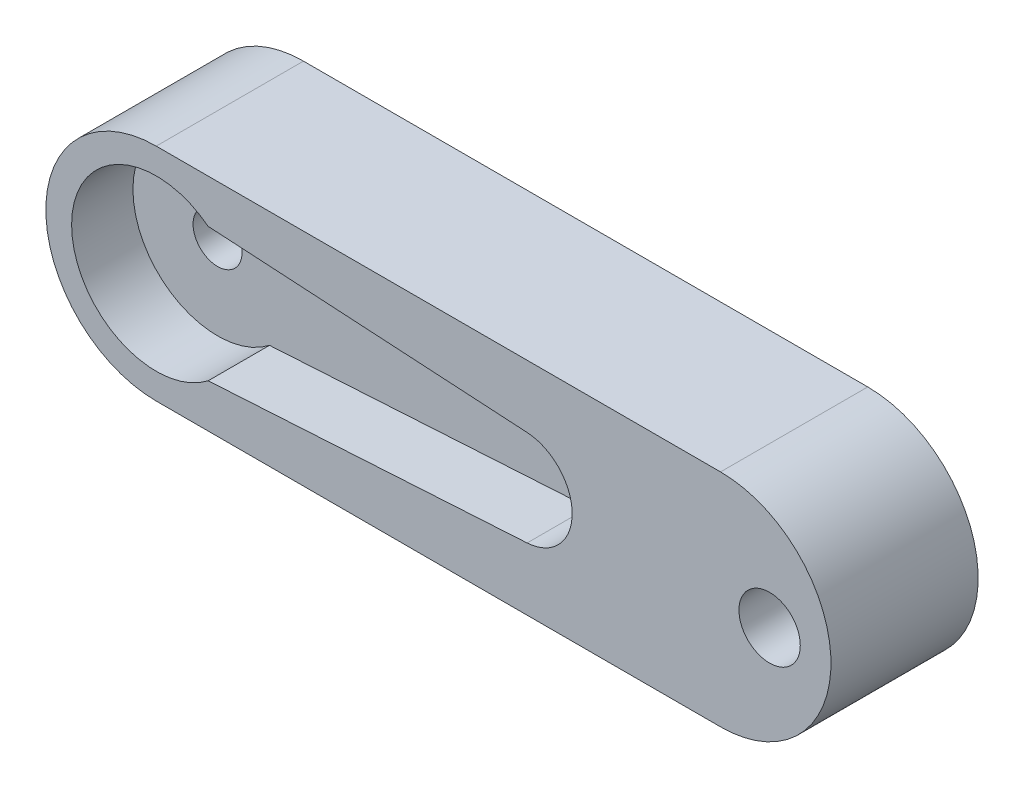
ISO-10303-21;
HEADER;
FILE_DESCRIPTION(('STEP AP214'),'2;1');
FILE_NAME('part.step','',(''),(''),'','','');
FILE_SCHEMA(('AUTOMOTIVE_DESIGN { 1 0 10303 214 1 1 1 1 }'));
ENDSEC;
DATA;
#1=APPLICATION_CONTEXT('core data for automotive mechanical design processes');
#2=APPLICATION_PROTOCOL_DEFINITION('international standard','automotive_design',2000,#1);
#3=PRODUCT_CONTEXT('',#1,'mechanical');
#4=PRODUCT('Part','Part','',(#3));
#5=PRODUCT_RELATED_PRODUCT_CATEGORY('part','',(#4));
#6=PRODUCT_DEFINITION_FORMATION('','',#4);
#7=PRODUCT_DEFINITION_CONTEXT('part definition',#1,'design');
#8=PRODUCT_DEFINITION('design','',#6,#7);
#9=PRODUCT_DEFINITION_SHAPE('','',#8);
#10=(LENGTH_UNIT() NAMED_UNIT(*) SI_UNIT(.MILLI.,.METRE.));
#11=(NAMED_UNIT(*) PLANE_ANGLE_UNIT() SI_UNIT($,.RADIAN.));
#12=(NAMED_UNIT(*) SI_UNIT($,.STERADIAN.) SOLID_ANGLE_UNIT());
#13=UNCERTAINTY_MEASURE_WITH_UNIT(LENGTH_MEASURE(1.E-05),#10,'distance_accuracy_value','');
#14=(GEOMETRIC_REPRESENTATION_CONTEXT(3) GLOBAL_UNCERTAINTY_ASSIGNED_CONTEXT((#13)) GLOBAL_UNIT_ASSIGNED_CONTEXT((#10,
#11,#12)) REPRESENTATION_CONTEXT('',''));
#15=CARTESIAN_POINT('',(0.,0.,0.));
#16=DIRECTION('',(0.,0.,1.));
#17=DIRECTION('',(1.,0.,0.));
#18=AXIS2_PLACEMENT_3D('',#15,#16,#17);
#19=CARTESIAN_POINT('',(0.,0.,0.));
#20=DIRECTION('',(0.,0.,1.));
#21=DIRECTION('',(1.,0.,0.));
#22=AXIS2_PLACEMENT_3D('',#19,#20,#21);
#23=CYLINDRICAL_SURFACE('',#22,1.);
#24=CARTESIAN_POINT('',(0.,0.,3.5));
#25=DIRECTION('',(0.,0.,1.));
#26=DIRECTION('',(1.,0.,0.));
#27=AXIS2_PLACEMENT_3D('',#24,#25,#26);
#28=CIRCLE('',#27,1.);
#29=CARTESIAN_POINT('',(1.,0.,3.5));
#30=VERTEX_POINT('',#29);
#31=EDGE_CURVE('E144',#30,#30,#28,.T.);
#32=ORIENTED_EDGE('',*,*,#31,.T.);
#33=EDGE_LOOP('',(#32));
#34=FACE_BOUND('',#33,.T.);
#35=CARTESIAN_POINT('',(0.,0.,1.5));
#36=DIRECTION('',(0.,0.,-1.));
#37=DIRECTION('',(-1.,0.,0.));
#38=AXIS2_PLACEMENT_3D('',#35,#36,#37);
#39=CIRCLE('',#38,1.);
#40=CARTESIAN_POINT('',(-1.,0.,1.5));
#41=VERTEX_POINT('',#40);
#42=EDGE_CURVE('E39',#41,#41,#39,.F.);
#43=ORIENTED_EDGE('',*,*,#42,.F.);
#44=EDGE_LOOP('',(#43));
#45=FACE_BOUND('',#44,.T.);
#46=ADVANCED_FACE('F35',(#34,#45),#23,.F.);
#47=CARTESIAN_POINT('',(0.,0.,6.));
#48=DIRECTION('',(0.,0.,-1.));
#49=DIRECTION('',(-1.,0.,0.));
#50=AXIS2_PLACEMENT_3D('',#47,#48,#49);
#51=CYLINDRICAL_SURFACE('',#50,4.5);
#52=CARTESIAN_POINT('',(0.,0.,0.));
#53=DIRECTION('',(0.,0.,1.));
#54=DIRECTION('',(1.,0.,0.));
#55=AXIS2_PLACEMENT_3D('',#52,#53,#54);
#56=CIRCLE('',#55,4.5);
#57=CARTESIAN_POINT('',(0.,4.5,0.));
#58=VERTEX_POINT('',#57);
#59=CARTESIAN_POINT('',(0.,-4.5,0.));
#60=VERTEX_POINT('',#59);
#61=EDGE_CURVE('E150',#58,#60,#56,.T.);
#62=ORIENTED_EDGE('',*,*,#61,.T.);
#63=DIRECTION('',(0.,0.,-1.));
#64=VECTOR('',#63,1.);
#65=CARTESIAN_POINT('',(0.,-4.5,6.));
#66=LINE('',#65,#64);
#67=CARTESIAN_POINT('',(0.,-4.5,6.));
#68=VERTEX_POINT('',#67);
#69=EDGE_CURVE('E11',#68,#60,#66,.T.);
#70=ORIENTED_EDGE('',*,*,#69,.F.);
#71=CARTESIAN_POINT('',(0.,0.,6.));
#72=DIRECTION('',(0.,0.,1.));
#73=DIRECTION('',(1.,0.,0.));
#74=AXIS2_PLACEMENT_3D('',#71,#72,#73);
#75=CIRCLE('',#74,4.5);
#76=CARTESIAN_POINT('',(0.,4.5,6.));
#77=VERTEX_POINT('',#76);
#78=EDGE_CURVE('E154',#77,#68,#75,.T.);
#79=ORIENTED_EDGE('',*,*,#78,.F.);
#80=DIRECTION('',(0.,0.,-1.));
#81=VECTOR('',#80,1.);
#82=CARTESIAN_POINT('',(0.,4.5,6.));
#83=LINE('',#82,#81);
#84=EDGE_CURVE('E160',#77,#58,#83,.T.);
#85=ORIENTED_EDGE('',*,*,#84,.T.);
#86=EDGE_LOOP('',(#62,#70,#79,#85));
#87=FACE_BOUND('',#86,.T.);
#88=ADVANCED_FACE('F37',(#87),#51,.T.);
#89=CARTESIAN_POINT('',(0.,-4.5,6.));
#90=DIRECTION('',(0.,1.,0.));
#91=DIRECTION('',(-1.,0.,0.));
#92=AXIS2_PLACEMENT_3D('',#89,#90,#91);
#93=PLANE('',#92);
#94=DIRECTION('',(1.,0.,0.));
#95=VECTOR('',#94,1.);
#96=CARTESIAN_POINT('',(0.,-4.5,0.));
#97=LINE('',#96,#95);
#98=CARTESIAN_POINT('',(23.,-4.5,0.));
#99=VERTEX_POINT('',#98);
#100=EDGE_CURVE('E163',#60,#99,#97,.T.);
#101=ORIENTED_EDGE('',*,*,#100,.T.);
#102=DIRECTION('',(0.,0.,-1.));
#103=VECTOR('',#102,1.);
#104=CARTESIAN_POINT('',(23.,-4.5,6.));
#105=LINE('',#104,#103);
#106=CARTESIAN_POINT('',(23.,-4.5,6.));
#107=VERTEX_POINT('',#106);
#108=EDGE_CURVE('E44',#107,#99,#105,.T.);
#109=ORIENTED_EDGE('',*,*,#108,.F.);
#110=DIRECTION('',(1.,0.,0.));
#111=VECTOR('',#110,1.);
#112=CARTESIAN_POINT('',(0.,-4.5,6.));
#113=LINE('',#112,#111);
#114=EDGE_CURVE('E89',#68,#107,#113,.T.);
#115=ORIENTED_EDGE('',*,*,#114,.F.);
#116=ORIENTED_EDGE('',*,*,#69,.T.);
#117=EDGE_LOOP('',(#101,#109,#115,#116));
#118=FACE_BOUND('',#117,.T.);
#119=ADVANCED_FACE('F211',(#118),#93,.F.);
#120=CARTESIAN_POINT('',(23.,0.,6.));
#121=DIRECTION('',(0.,0.,-1.));
#122=DIRECTION('',(-1.,0.,0.));
#123=AXIS2_PLACEMENT_3D('',#120,#121,#122);
#124=CYLINDRICAL_SURFACE('',#123,4.5);
#125=CARTESIAN_POINT('',(23.,0.,0.));
#126=DIRECTION('',(0.,0.,1.));
#127=DIRECTION('',(1.,0.,0.));
#128=AXIS2_PLACEMENT_3D('',#125,#126,#127);
#129=CIRCLE('',#128,4.5);
#130=CARTESIAN_POINT('',(23.,4.5,0.));
#131=VERTEX_POINT('',#130);
#132=EDGE_CURVE('E165',#99,#131,#129,.T.);
#133=ORIENTED_EDGE('',*,*,#132,.T.);
#134=DIRECTION('',(0.,0.,-1.));
#135=VECTOR('',#134,1.);
#136=CARTESIAN_POINT('',(23.,4.5,6.));
#137=LINE('',#136,#135);
#138=CARTESIAN_POINT('',(23.,4.5,6.));
#139=VERTEX_POINT('',#138);
#140=EDGE_CURVE('E169',#139,#131,#137,.T.);
#141=ORIENTED_EDGE('',*,*,#140,.F.);
#142=CARTESIAN_POINT('',(23.,0.,6.));
#143=DIRECTION('',(0.,0.,1.));
#144=DIRECTION('',(1.,0.,0.));
#145=AXIS2_PLACEMENT_3D('',#142,#143,#144);
#146=CIRCLE('',#145,4.5);
#147=EDGE_CURVE('E157',#107,#139,#146,.T.);
#148=ORIENTED_EDGE('',*,*,#147,.F.);
#149=ORIENTED_EDGE('',*,*,#108,.T.);
#150=EDGE_LOOP('',(#133,#141,#148,#149));
#151=FACE_BOUND('',#150,.T.);
#152=ADVANCED_FACE('F216',(#151),#124,.T.);
#153=CARTESIAN_POINT('',(0.,4.5,6.));
#154=DIRECTION('',(0.,-1.,0.));
#155=DIRECTION('',(1.,0.,0.));
#156=AXIS2_PLACEMENT_3D('',#153,#154,#155);
#157=PLANE('',#156);
#158=DIRECTION('',(-1.,0.,0.));
#159=VECTOR('',#158,1.);
#160=CARTESIAN_POINT('',(0.,4.5,0.));
#161=LINE('',#160,#159);
#162=EDGE_CURVE('E82',#131,#58,#161,.T.);
#163=ORIENTED_EDGE('',*,*,#162,.T.);
#164=ORIENTED_EDGE('',*,*,#84,.F.);
#165=DIRECTION('',(-1.,0.,0.));
#166=VECTOR('',#165,1.);
#167=CARTESIAN_POINT('',(0.,4.5,6.));
#168=LINE('',#167,#166);
#169=EDGE_CURVE('E61',#139,#77,#168,.T.);
#170=ORIENTED_EDGE('',*,*,#169,.F.);
#171=ORIENTED_EDGE('',*,*,#140,.T.);
#172=EDGE_LOOP('',(#163,#164,#170,#171));
#173=FACE_BOUND('',#172,.T.);
#174=ADVANCED_FACE('F204',(#173),#157,.F.);
#175=CARTESIAN_POINT('',(0.,0.,6.));
#176=DIRECTION('',(0.,0.,1.));
#177=DIRECTION('',(1.,0.,0.));
#178=AXIS2_PLACEMENT_3D('',#175,#176,#177);
#179=PLANE('',#178);
#180=CARTESIAN_POINT('',(25.,0.,6.));
#181=DIRECTION('',(0.,0.,1.));
#182=DIRECTION('',(1.,0.,0.));
#183=AXIS2_PLACEMENT_3D('',#180,#181,#182);
#184=CIRCLE('',#183,1.25);
#185=CARTESIAN_POINT('',(26.25,0.,6.));
#186=VERTEX_POINT('',#185);
#187=EDGE_CURVE('E185',#186,#186,#184,.T.);
#188=ORIENTED_EDGE('',*,*,#187,.F.);
#189=EDGE_LOOP('',(#188));
#190=FACE_BOUND('',#189,.T.);
#191=CARTESIAN_POINT('',(0.,0.,6.));
#192=DIRECTION('',(0.,0.,1.));
#193=DIRECTION('',(1.,0.,0.));
#194=AXIS2_PLACEMENT_3D('',#191,#192,#193);
#195=CIRCLE('',#194,3.45);
#196=CARTESIAN_POINT('',(2.11586270821148,2.725,6.));
#197=VERTEX_POINT('',#196);
#198=CARTESIAN_POINT('',(2.11586270821148,-2.725,6.));
#199=VERTEX_POINT('',#198);
#200=EDGE_CURVE('E52',#197,#199,#195,.T.);
#201=ORIENTED_EDGE('',*,*,#200,.F.);
#202=DIRECTION('',(-0.998227829931133,0.0595079788850305,0.));
#203=VECTOR('',#202,1.);
#204=CARTESIAN_POINT('',(2.11586270821148,2.725,6.));
#205=LINE('',#204,#203);
#206=CARTESIAN_POINT('',(15.1162465675134,1.95,6.));
#207=VERTEX_POINT('',#206);
#208=EDGE_CURVE('E131',#207,#197,#205,.T.);
#209=ORIENTED_EDGE('',*,*,#208,.F.);
#210=CARTESIAN_POINT('',(15.,0.,6.));
#211=DIRECTION('',(0.,0.,1.));
#212=DIRECTION('',(-1.,0.,0.));
#213=AXIS2_PLACEMENT_3D('',#210,#211,#212);
#214=CIRCLE('',#213,1.95346186665075);
#215=CARTESIAN_POINT('',(15.1162465675134,-1.95,6.));
#216=VERTEX_POINT('',#215);
#217=EDGE_CURVE('E134',#216,#207,#214,.T.);
#218=ORIENTED_EDGE('',*,*,#217,.F.);
#219=DIRECTION('',(0.998227829931133,0.0595079788850305,0.));
#220=VECTOR('',#219,1.);
#221=CARTESIAN_POINT('',(2.11586270821148,-2.725,6.));
#222=LINE('',#221,#220);
#223=EDGE_CURVE('E143',#199,#216,#222,.T.);
#224=ORIENTED_EDGE('',*,*,#223,.F.);
#225=EDGE_LOOP('',(#201,#209,#218,#224));
#226=FACE_BOUND('',#225,.T.);
#227=ORIENTED_EDGE('',*,*,#78,.T.);
#228=ORIENTED_EDGE('',*,*,#114,.T.);
#229=ORIENTED_EDGE('',*,*,#147,.T.);
#230=ORIENTED_EDGE('',*,*,#169,.T.);
#231=EDGE_LOOP('',(#227,#228,#229,#230));
#232=FACE_BOUND('',#231,.T.);
#233=ADVANCED_FACE('F201',(#190,#226,#232),#179,.T.);
#234=CARTESIAN_POINT('',(0.,0.,0.));
#235=DIRECTION('',(0.,0.,1.));
#236=DIRECTION('',(1.,0.,0.));
#237=AXIS2_PLACEMENT_3D('',#234,#235,#236);
#238=PLANE('',#237);
#239=CARTESIAN_POINT('',(25.,0.,0.));
#240=DIRECTION('',(0.,0.,1.));
#241=DIRECTION('',(1.,0.,0.));
#242=AXIS2_PLACEMENT_3D('',#239,#240,#241);
#243=CIRCLE('',#242,1.25);
#244=CARTESIAN_POINT('',(26.25,0.,0.));
#245=VERTEX_POINT('',#244);
#246=EDGE_CURVE('E183',#245,#245,#243,.T.);
#247=ORIENTED_EDGE('',*,*,#246,.T.);
#248=EDGE_LOOP('',(#247));
#249=FACE_BOUND('',#248,.T.);
#250=CARTESIAN_POINT('',(0.,0.,0.));
#251=DIRECTION('',(0.,0.,-1.));
#252=DIRECTION('',(-1.,0.,0.));
#253=AXIS2_PLACEMENT_3D('',#250,#251,#252);
#254=CIRCLE('',#253,2.);
#255=CARTESIAN_POINT('',(-2.,0.,0.));
#256=VERTEX_POINT('',#255);
#257=EDGE_CURVE('E137',#256,#256,#254,.T.);
#258=ORIENTED_EDGE('',*,*,#257,.F.);
#259=EDGE_LOOP('',(#258));
#260=FACE_BOUND('',#259,.T.);
#261=ORIENTED_EDGE('',*,*,#61,.F.);
#262=ORIENTED_EDGE('',*,*,#162,.F.);
#263=ORIENTED_EDGE('',*,*,#132,.F.);
#264=ORIENTED_EDGE('',*,*,#100,.F.);
#265=EDGE_LOOP('',(#261,#262,#263,#264));
#266=FACE_BOUND('',#265,.T.);
#267=ADVANCED_FACE('F191',(#249,#260,#266),#238,.F.);
#268=CARTESIAN_POINT('',(0.,0.,3.5));
#269=DIRECTION('',(0.,0.,1.));
#270=DIRECTION('',(1.,0.,0.));
#271=AXIS2_PLACEMENT_3D('',#268,#269,#270);
#272=CYLINDRICAL_SURFACE('',#271,3.45);
#273=ORIENTED_EDGE('',*,*,#200,.T.);
#274=DIRECTION('',(0.,0.,1.));
#275=VECTOR('',#274,1.);
#276=CARTESIAN_POINT('',(2.11586270821148,-2.725,3.5));
#277=LINE('',#276,#275);
#278=CARTESIAN_POINT('',(2.11586270821148,-2.725,3.5));
#279=VERTEX_POINT('',#278);
#280=EDGE_CURVE('E109',#279,#199,#277,.T.);
#281=ORIENTED_EDGE('',*,*,#280,.F.);
#282=CARTESIAN_POINT('',(0.,0.,3.5));
#283=DIRECTION('',(0.,0.,1.));
#284=DIRECTION('',(1.,0.,0.));
#285=AXIS2_PLACEMENT_3D('',#282,#283,#284);
#286=CIRCLE('',#285,3.45);
#287=CARTESIAN_POINT('',(2.11586270821148,2.725,3.5));
#288=VERTEX_POINT('',#287);
#289=EDGE_CURVE('E113',#288,#279,#286,.T.);
#290=ORIENTED_EDGE('',*,*,#289,.F.);
#291=DIRECTION('',(0.,0.,1.));
#292=VECTOR('',#291,1.);
#293=CARTESIAN_POINT('',(2.11586270821148,2.725,3.5));
#294=LINE('',#293,#292);
#295=EDGE_CURVE('E148',#288,#197,#294,.T.);
#296=ORIENTED_EDGE('',*,*,#295,.T.);
#297=EDGE_LOOP('',(#273,#281,#290,#296));
#298=FACE_BOUND('',#297,.T.);
#299=ADVANCED_FACE('F111',(#298),#272,.F.);
#300=CARTESIAN_POINT('',(2.11586270821148,2.725,3.5));
#301=DIRECTION('',(0.0595079788850305,0.998227829931133,0.));
#302=DIRECTION('',(-0.998227829931133,0.0595079788850305,0.));
#303=AXIS2_PLACEMENT_3D('',#300,#301,#302);
#304=PLANE('',#303);
#305=ORIENTED_EDGE('',*,*,#208,.T.);
#306=ORIENTED_EDGE('',*,*,#295,.F.);
#307=DIRECTION('',(-0.998227829931133,0.0595079788850305,0.));
#308=VECTOR('',#307,1.);
#309=CARTESIAN_POINT('',(2.11586270821148,2.725,3.5));
#310=LINE('',#309,#308);
#311=CARTESIAN_POINT('',(15.1162465675134,1.95,3.5));
#312=VERTEX_POINT('',#311);
#313=EDGE_CURVE('E119',#312,#288,#310,.T.);
#314=ORIENTED_EDGE('',*,*,#313,.F.);
#315=DIRECTION('',(0.,0.,1.));
#316=VECTOR('',#315,1.);
#317=CARTESIAN_POINT('',(15.1162465675134,1.95,3.5));
#318=LINE('',#317,#316);
#319=EDGE_CURVE('E151',#312,#207,#318,.T.);
#320=ORIENTED_EDGE('',*,*,#319,.T.);
#321=EDGE_LOOP('',(#305,#306,#314,#320));
#322=FACE_BOUND('',#321,.T.);
#323=ADVANCED_FACE('F223',(#322),#304,.F.);
#324=CARTESIAN_POINT('',(15.,0.,3.5));
#325=DIRECTION('',(0.,0.,1.));
#326=DIRECTION('',(1.,0.,0.));
#327=AXIS2_PLACEMENT_3D('',#324,#325,#326);
#328=CYLINDRICAL_SURFACE('',#327,1.95346186665075);
#329=ORIENTED_EDGE('',*,*,#217,.T.);
#330=ORIENTED_EDGE('',*,*,#319,.F.);
#331=CARTESIAN_POINT('',(15.,0.,3.5));
#332=DIRECTION('',(0.,0.,1.));
#333=DIRECTION('',(-1.,0.,0.));
#334=AXIS2_PLACEMENT_3D('',#331,#332,#333);
#335=CIRCLE('',#334,1.95346186665075);
#336=CARTESIAN_POINT('',(15.1162465675134,-1.95,3.5));
#337=VERTEX_POINT('',#336);
#338=EDGE_CURVE('E127',#337,#312,#335,.T.);
#339=ORIENTED_EDGE('',*,*,#338,.F.);
#340=DIRECTION('',(0.,0.,1.));
#341=VECTOR('',#340,1.);
#342=CARTESIAN_POINT('',(15.1162465675134,-1.95,3.5));
#343=LINE('',#342,#341);
#344=EDGE_CURVE('E118',#337,#216,#343,.T.);
#345=ORIENTED_EDGE('',*,*,#344,.T.);
#346=EDGE_LOOP('',(#329,#330,#339,#345));
#347=FACE_BOUND('',#346,.T.);
#348=ADVANCED_FACE('F241',(#347),#328,.F.);
#349=CARTESIAN_POINT('',(2.11586270821148,-2.725,3.5));
#350=DIRECTION('',(0.0595079788850305,-0.998227829931133,0.));
#351=DIRECTION('',(0.998227829931133,0.0595079788850305,0.));
#352=AXIS2_PLACEMENT_3D('',#349,#350,#351);
#353=PLANE('',#352);
#354=ORIENTED_EDGE('',*,*,#223,.T.);
#355=ORIENTED_EDGE('',*,*,#344,.F.);
#356=DIRECTION('',(0.998227829931133,0.0595079788850305,0.));
#357=VECTOR('',#356,1.);
#358=CARTESIAN_POINT('',(2.11586270821148,-2.725,3.5));
#359=LINE('',#358,#357);
#360=EDGE_CURVE('E122',#279,#337,#359,.T.);
#361=ORIENTED_EDGE('',*,*,#360,.F.);
#362=ORIENTED_EDGE('',*,*,#280,.T.);
#363=EDGE_LOOP('',(#354,#355,#361,#362));
#364=FACE_BOUND('',#363,.T.);
#365=ADVANCED_FACE('F123',(#364),#353,.F.);
#366=CARTESIAN_POINT('',(0.,0.,3.5));
#367=DIRECTION('',(0.,0.,1.));
#368=DIRECTION('',(1.,0.,0.));
#369=AXIS2_PLACEMENT_3D('',#366,#367,#368);
#370=PLANE('',#369);
#371=ORIENTED_EDGE('',*,*,#31,.F.);
#372=EDGE_LOOP('',(#371));
#373=FACE_BOUND('',#372,.T.);
#374=ORIENTED_EDGE('',*,*,#289,.T.);
#375=ORIENTED_EDGE('',*,*,#360,.T.);
#376=ORIENTED_EDGE('',*,*,#338,.T.);
#377=ORIENTED_EDGE('',*,*,#313,.T.);
#378=EDGE_LOOP('',(#374,#375,#376,#377));
#379=FACE_BOUND('',#378,.T.);
#380=ADVANCED_FACE('F129',(#373,#379),#370,.T.);
#381=CARTESIAN_POINT('',(0.,0.,1.5));
#382=DIRECTION('',(0.,0.,-1.));
#383=DIRECTION('',(-1.,0.,0.));
#384=AXIS2_PLACEMENT_3D('',#381,#382,#383);
#385=PLANE('',#384);
#386=CARTESIAN_POINT('',(0.,0.,1.5));
#387=DIRECTION('',(0.,0.,-1.));
#388=DIRECTION('',(-1.,0.,0.));
#389=AXIS2_PLACEMENT_3D('',#386,#387,#388);
#390=CIRCLE('',#389,2.);
#391=CARTESIAN_POINT('',(-2.,0.,1.5));
#392=VERTEX_POINT('',#391);
#393=EDGE_CURVE('E176',#392,#392,#390,.T.);
#394=ORIENTED_EDGE('',*,*,#393,.T.);
#395=EDGE_LOOP('',(#394));
#396=FACE_BOUND('',#395,.T.);
#397=ORIENTED_EDGE('',*,*,#42,.T.);
#398=EDGE_LOOP('',(#397));
#399=FACE_BOUND('',#398,.T.);
#400=ADVANCED_FACE('F237',(#396,#399),#385,.T.);
#401=CARTESIAN_POINT('',(0.,0.,1.5));
#402=DIRECTION('',(0.,0.,-1.));
#403=DIRECTION('',(-1.,0.,0.));
#404=AXIS2_PLACEMENT_3D('',#401,#402,#403);
#405=CYLINDRICAL_SURFACE('',#404,2.);
#406=ORIENTED_EDGE('',*,*,#393,.F.);
#407=EDGE_LOOP('',(#406));
#408=FACE_BOUND('',#407,.T.);
#409=ORIENTED_EDGE('',*,*,#257,.T.);
#410=EDGE_LOOP('',(#409));
#411=FACE_BOUND('',#410,.T.);
#412=ADVANCED_FACE('F197',(#408,#411),#405,.F.);
#413=CARTESIAN_POINT('',(25.,0.,0.));
#414=DIRECTION('',(0.,0.,1.));
#415=DIRECTION('',(1.,0.,0.));
#416=AXIS2_PLACEMENT_3D('',#413,#414,#415);
#417=CYLINDRICAL_SURFACE('',#416,1.25);
#418=ORIENTED_EDGE('',*,*,#246,.F.);
#419=EDGE_LOOP('',(#418));
#420=FACE_BOUND('',#419,.T.);
#421=ORIENTED_EDGE('',*,*,#187,.T.);
#422=EDGE_LOOP('',(#421));
#423=FACE_BOUND('',#422,.T.);
#424=ADVANCED_FACE('F194',(#420,#423),#417,.F.);
#425=CLOSED_SHELL('',(#46,#88,#119,#152,#174,#233,#267,#299,#323,#348,#365,#380,#400,#412,#424));
#426=MANIFOLD_SOLID_BREP('B2',#425);
#427=ADVANCED_BREP_SHAPE_REPRESENTATION('',(#18,#426),#14);
#428=SHAPE_DEFINITION_REPRESENTATION(#9,#427);
ENDSEC;
END-ISO-10303-21;
